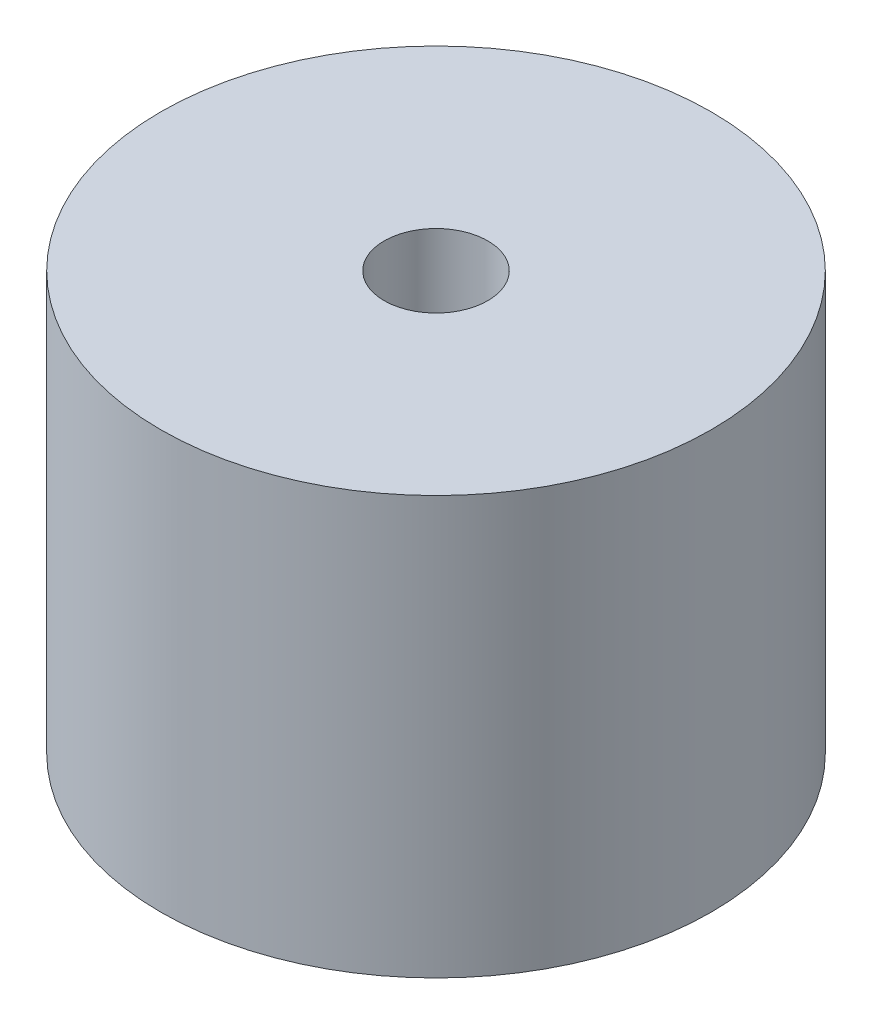
ISO-10303-21;
HEADER;
FILE_DESCRIPTION(('STEP AP214'),'2;1');
FILE_NAME('part.step','',(''),(''),'','','');
FILE_SCHEMA(('AUTOMOTIVE_DESIGN { 1 0 10303 214 1 1 1 1 }'));
ENDSEC;
DATA;
#1=APPLICATION_CONTEXT('core data for automotive mechanical design processes');
#2=APPLICATION_PROTOCOL_DEFINITION('international standard','automotive_design',2000,#1);
#3=PRODUCT_CONTEXT('',#1,'mechanical');
#4=PRODUCT('Part','Part','',(#3));
#5=PRODUCT_RELATED_PRODUCT_CATEGORY('part','',(#4));
#6=PRODUCT_DEFINITION_FORMATION('','',#4);
#7=PRODUCT_DEFINITION_CONTEXT('part definition',#1,'design');
#8=PRODUCT_DEFINITION('design','',#6,#7);
#9=PRODUCT_DEFINITION_SHAPE('','',#8);
#10=(LENGTH_UNIT() NAMED_UNIT(*) SI_UNIT(.MILLI.,.METRE.));
#11=(NAMED_UNIT(*) PLANE_ANGLE_UNIT() SI_UNIT($,.RADIAN.));
#12=(NAMED_UNIT(*) SI_UNIT($,.STERADIAN.) SOLID_ANGLE_UNIT());
#13=UNCERTAINTY_MEASURE_WITH_UNIT(LENGTH_MEASURE(1.E-05),#10,'distance_accuracy_value','');
#14=(GEOMETRIC_REPRESENTATION_CONTEXT(3) GLOBAL_UNCERTAINTY_ASSIGNED_CONTEXT((#13)) GLOBAL_UNIT_ASSIGNED_CONTEXT((#10,
#11,#12)) REPRESENTATION_CONTEXT('',''));
#15=CARTESIAN_POINT('',(0.,0.,0.));
#16=DIRECTION('',(0.,0.,1.));
#17=DIRECTION('',(1.,0.,0.));
#18=AXIS2_PLACEMENT_3D('',#15,#16,#17);
#19=CARTESIAN_POINT('',(0.,67.,0.));
#20=DIRECTION('',(0.,-1.,0.));
#21=DIRECTION('',(0.,0.,-1.));
#22=AXIS2_PLACEMENT_3D('',#19,#20,#21);
#23=CYLINDRICAL_SURFACE('',#22,6.);
#24=CARTESIAN_POINT('',(0.,64.,0.));
#25=DIRECTION('',(0.,1.,0.));
#26=DIRECTION('',(0.,0.,1.));
#27=AXIS2_PLACEMENT_3D('',#24,#25,#26);
#28=CIRCLE('',#27,6.);
#29=CARTESIAN_POINT('',(0.,64.,6.));
#30=VERTEX_POINT('',#29);
#31=EDGE_CURVE('E38',#30,#30,#28,.T.);
#32=ORIENTED_EDGE('',*,*,#31,.T.);
#33=EDGE_LOOP('',(#32));
#34=FACE_BOUND('',#33,.T.);
#35=CARTESIAN_POINT('',(0.,54.1,0.));
#36=DIRECTION('',(0.,-1.,0.));
#37=DIRECTION('',(0.,0.,-1.));
#38=AXIS2_PLACEMENT_3D('',#35,#36,#37);
#39=CIRCLE('',#38,6.);
#40=CARTESIAN_POINT('',(0.,54.1,-6.));
#41=VERTEX_POINT('',#40);
#42=EDGE_CURVE('E50',#41,#41,#39,.T.);
#43=ORIENTED_EDGE('',*,*,#42,.T.);
#44=EDGE_LOOP('',(#43));
#45=FACE_BOUND('',#44,.T.);
#46=ADVANCED_FACE('F32',(#34,#45),#23,.F.);
#47=CARTESIAN_POINT('',(0.,67.,0.));
#48=DIRECTION('',(0.,-1.,0.));
#49=DIRECTION('',(0.,0.,-1.));
#50=AXIS2_PLACEMENT_3D('',#47,#48,#49);
#51=CYLINDRICAL_SURFACE('',#50,8.5);
#52=CARTESIAN_POINT('',(0.,67.,0.));
#53=DIRECTION('',(0.,1.,0.));
#54=DIRECTION('',(0.,0.,1.));
#55=AXIS2_PLACEMENT_3D('',#52,#53,#54);
#56=CIRCLE('',#55,8.5);
#57=CARTESIAN_POINT('',(0.,67.,8.5));
#58=VERTEX_POINT('',#57);
#59=EDGE_CURVE('E10',#58,#58,#56,.T.);
#60=ORIENTED_EDGE('',*,*,#59,.F.);
#61=EDGE_LOOP('',(#60));
#62=FACE_BOUND('',#61,.T.);
#63=CARTESIAN_POINT('',(0.,54.1,0.));
#64=DIRECTION('',(0.,-1.,0.));
#65=DIRECTION('',(0.,0.,-1.));
#66=AXIS2_PLACEMENT_3D('',#63,#64,#65);
#67=CIRCLE('',#66,8.5);
#68=CARTESIAN_POINT('',(0.,54.1,-8.5));
#69=VERTEX_POINT('',#68);
#70=EDGE_CURVE('E54',#69,#69,#67,.T.);
#71=ORIENTED_EDGE('',*,*,#70,.F.);
#72=EDGE_LOOP('',(#71));
#73=FACE_BOUND('',#72,.T.);
#74=ADVANCED_FACE('F60',(#62,#73),#51,.T.);
#75=CARTESIAN_POINT('',(0.,67.,0.));
#76=DIRECTION('',(0.,1.,0.));
#77=DIRECTION('',(0.,0.,1.));
#78=AXIS2_PLACEMENT_3D('',#75,#76,#77);
#79=PLANE('',#78);
#80=ORIENTED_EDGE('',*,*,#59,.T.);
#81=EDGE_LOOP('',(#80));
#82=FACE_BOUND('',#81,.T.);
#83=CARTESIAN_POINT('',(0.,67.,0.));
#84=DIRECTION('',(0.,1.,0.));
#85=DIRECTION('',(0.,0.,1.));
#86=AXIS2_PLACEMENT_3D('',#83,#84,#85);
#87=CIRCLE('',#86,1.6);
#88=CARTESIAN_POINT('',(0.,67.,1.6));
#89=VERTEX_POINT('',#88);
#90=EDGE_CURVE('E46',#89,#89,#87,.T.);
#91=ORIENTED_EDGE('',*,*,#90,.F.);
#92=EDGE_LOOP('',(#91));
#93=FACE_BOUND('',#92,.T.);
#94=ADVANCED_FACE('F62',(#82,#93),#79,.T.);
#95=CARTESIAN_POINT('',(0.,64.,0.));
#96=DIRECTION('',(0.,1.,0.));
#97=DIRECTION('',(0.,0.,1.));
#98=AXIS2_PLACEMENT_3D('',#95,#96,#97);
#99=PLANE('',#98);
#100=CARTESIAN_POINT('',(0.,64.,0.));
#101=DIRECTION('',(0.,1.,0.));
#102=DIRECTION('',(0.,0.,1.));
#103=AXIS2_PLACEMENT_3D('',#100,#101,#102);
#104=CIRCLE('',#103,1.6);
#105=CARTESIAN_POINT('',(0.,64.,1.6));
#106=VERTEX_POINT('',#105);
#107=EDGE_CURVE('E42',#106,#106,#104,.T.);
#108=ORIENTED_EDGE('',*,*,#107,.T.);
#109=EDGE_LOOP('',(#108));
#110=FACE_BOUND('',#109,.T.);
#111=ORIENTED_EDGE('',*,*,#31,.F.);
#112=EDGE_LOOP('',(#111));
#113=FACE_BOUND('',#112,.T.);
#114=ADVANCED_FACE('F68',(#110,#113),#99,.F.);
#115=CARTESIAN_POINT('',(0.,64.,0.));
#116=DIRECTION('',(0.,1.,0.));
#117=DIRECTION('',(0.,0.,1.));
#118=AXIS2_PLACEMENT_3D('',#115,#116,#117);
#119=CYLINDRICAL_SURFACE('',#118,1.6);
#120=ORIENTED_EDGE('',*,*,#107,.F.);
#121=EDGE_LOOP('',(#120));
#122=FACE_BOUND('',#121,.T.);
#123=ORIENTED_EDGE('',*,*,#90,.T.);
#124=EDGE_LOOP('',(#123));
#125=FACE_BOUND('',#124,.T.);
#126=ADVANCED_FACE('F73',(#122,#125),#119,.F.);
#127=CARTESIAN_POINT('',(0.,54.1,0.));
#128=DIRECTION('',(0.,-1.,0.));
#129=DIRECTION('',(0.,0.,-1.));
#130=AXIS2_PLACEMENT_3D('',#127,#128,#129);
#131=PLANE('',#130);
#132=ORIENTED_EDGE('',*,*,#42,.F.);
#133=EDGE_LOOP('',(#132));
#134=FACE_BOUND('',#133,.T.);
#135=ORIENTED_EDGE('',*,*,#70,.T.);
#136=EDGE_LOOP('',(#135));
#137=FACE_BOUND('',#136,.T.);
#138=ADVANCED_FACE('F58',(#134,#137),#131,.T.);
#139=CLOSED_SHELL('',(#46,#74,#94,#114,#126,#138));
#140=MANIFOLD_SOLID_BREP('B2',#139);
#141=ADVANCED_BREP_SHAPE_REPRESENTATION('',(#18,#140),#14);
#142=SHAPE_DEFINITION_REPRESENTATION(#9,#141);
ENDSEC;
END-ISO-10303-21;
